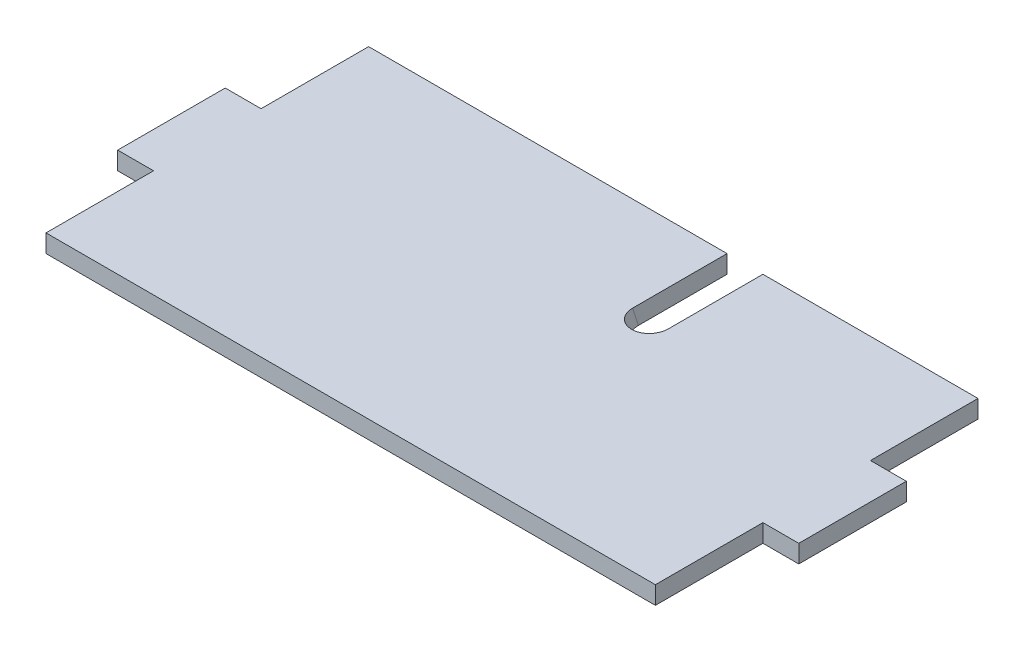
ISO-10303-21;
HEADER;
FILE_DESCRIPTION(('STEP AP214'),'2;1');
FILE_NAME('part.step','',(''),(''),'','','');
FILE_SCHEMA(('AUTOMOTIVE_DESIGN { 1 0 10303 214 1 1 1 1 }'));
ENDSEC;
DATA;
#1=APPLICATION_CONTEXT('core data for automotive mechanical design processes');
#2=APPLICATION_PROTOCOL_DEFINITION('international standard','automotive_design',2000,#1);
#3=PRODUCT_CONTEXT('',#1,'mechanical');
#4=PRODUCT('Part','Part','',(#3));
#5=PRODUCT_RELATED_PRODUCT_CATEGORY('part','',(#4));
#6=PRODUCT_DEFINITION_FORMATION('','',#4);
#7=PRODUCT_DEFINITION_CONTEXT('part definition',#1,'design');
#8=PRODUCT_DEFINITION('design','',#6,#7);
#9=PRODUCT_DEFINITION_SHAPE('','',#8);
#10=(LENGTH_UNIT() NAMED_UNIT(*) SI_UNIT(.MILLI.,.METRE.));
#11=(NAMED_UNIT(*) PLANE_ANGLE_UNIT() SI_UNIT($,.RADIAN.));
#12=(NAMED_UNIT(*) SI_UNIT($,.STERADIAN.) SOLID_ANGLE_UNIT());
#13=UNCERTAINTY_MEASURE_WITH_UNIT(LENGTH_MEASURE(1.E-05),#10,'distance_accuracy_value','');
#14=(GEOMETRIC_REPRESENTATION_CONTEXT(3) GLOBAL_UNCERTAINTY_ASSIGNED_CONTEXT((#13)) GLOBAL_UNIT_ASSIGNED_CONTEXT((#10,
#11,#12)) REPRESENTATION_CONTEXT('',''));
#15=CARTESIAN_POINT('',(0.,0.,0.));
#16=DIRECTION('',(0.,0.,1.));
#17=DIRECTION('',(1.,0.,0.));
#18=AXIS2_PLACEMENT_3D('',#15,#16,#17);
#19=CARTESIAN_POINT('',(-215.9,6.35,-88.9));
#20=DIRECTION('',(0.,0.,1.));
#21=DIRECTION('',(1.,0.,0.));
#22=AXIS2_PLACEMENT_3D('',#19,#20,#21);
#23=PLANE('',#22);
#24=DIRECTION('',(-1.,0.,0.));
#25=VECTOR('',#24,1.);
#26=CARTESIAN_POINT('',(-215.9,6.35,-88.9));
#27=LINE('',#26,#25);
#28=CARTESIAN_POINT('',(38.0999999999983,6.35,-88.9));
#29=VERTEX_POINT('',#28);
#30=CARTESIAN_POINT('',(-215.9,6.35,-88.9));
#31=VERTEX_POINT('',#30);
#32=EDGE_CURVE('E243',#29,#31,#27,.T.);
#33=ORIENTED_EDGE('',*,*,#32,.F.);
#34=DIRECTION('',(0.,1.,0.));
#35=VECTOR('',#34,1.);
#36=CARTESIAN_POINT('',(38.0999999999983,6.35,-88.9));
#37=LINE('',#36,#35);
#38=CARTESIAN_POINT('',(38.0999999999983,-6.35,-88.9));
#39=VERTEX_POINT('',#38);
#40=EDGE_CURVE('E345',#39,#29,#37,.T.);
#41=ORIENTED_EDGE('',*,*,#40,.F.);
#42=DIRECTION('',(-1.,0.,0.));
#43=VECTOR('',#42,1.);
#44=CARTESIAN_POINT('',(-215.9,-6.35,-88.9));
#45=LINE('',#44,#43);
#46=CARTESIAN_POINT('',(-215.9,-6.35,-88.9));
#47=VERTEX_POINT('',#46);
#48=EDGE_CURVE('E189',#39,#47,#45,.T.);
#49=ORIENTED_EDGE('',*,*,#48,.T.);
#50=DIRECTION('',(0.,-1.,0.));
#51=VECTOR('',#50,1.);
#52=CARTESIAN_POINT('',(-215.9,6.35,-88.9));
#53=LINE('',#52,#51);
#54=EDGE_CURVE('E195',#31,#47,#53,.T.);
#55=ORIENTED_EDGE('',*,*,#54,.F.);
#56=EDGE_LOOP('',(#33,#41,#49,#55));
#57=FACE_BOUND('',#56,.T.);
#58=ADVANCED_FACE('F42',(#57),#23,.F.);
#59=CARTESIAN_POINT('',(-215.9,6.35,-88.9));
#60=DIRECTION('',(1.,0.,0.));
#61=DIRECTION('',(0.,0.,-1.));
#62=AXIS2_PLACEMENT_3D('',#59,#60,#61);
#63=PLANE('',#62);
#64=DIRECTION('',(0.,0.,1.));
#65=VECTOR('',#64,1.);
#66=CARTESIAN_POINT('',(-215.9,-6.35,-88.9));
#67=LINE('',#66,#65);
#68=CARTESIAN_POINT('',(-215.9,-6.35,-12.7));
#69=VERTEX_POINT('',#68);
#70=EDGE_CURVE('E164',#47,#69,#67,.T.);
#71=ORIENTED_EDGE('',*,*,#70,.T.);
#72=DIRECTION('',(0.,-1.,0.));
#73=VECTOR('',#72,1.);
#74=CARTESIAN_POINT('',(-215.9,6.35,-12.7));
#75=LINE('',#74,#73);
#76=CARTESIAN_POINT('',(-215.9,6.35,-12.7));
#77=VERTEX_POINT('',#76);
#78=EDGE_CURVE('E235',#77,#69,#75,.T.);
#79=ORIENTED_EDGE('',*,*,#78,.F.);
#80=DIRECTION('',(0.,0.,1.));
#81=VECTOR('',#80,1.);
#82=CARTESIAN_POINT('',(-215.9,6.35,-88.9));
#83=LINE('',#82,#81);
#84=EDGE_CURVE('E175',#31,#77,#83,.T.);
#85=ORIENTED_EDGE('',*,*,#84,.F.);
#86=ORIENTED_EDGE('',*,*,#54,.T.);
#87=EDGE_LOOP('',(#71,#79,#85,#86));
#88=FACE_BOUND('',#87,.T.);
#89=ADVANCED_FACE('F375',(#88),#63,.F.);
#90=CARTESIAN_POINT('',(-241.3,6.35,-12.7));
#91=DIRECTION('',(0.,0.,1.));
#92=DIRECTION('',(1.,0.,0.));
#93=AXIS2_PLACEMENT_3D('',#90,#91,#92);
#94=PLANE('',#93);
#95=DIRECTION('',(-1.,0.,0.));
#96=VECTOR('',#95,1.);
#97=CARTESIAN_POINT('',(-241.3,-6.35,-12.7));
#98=LINE('',#97,#96);
#99=CARTESIAN_POINT('',(-241.3,-6.35,-12.7));
#100=VERTEX_POINT('',#99);
#101=EDGE_CURVE('E198',#69,#100,#98,.T.);
#102=ORIENTED_EDGE('',*,*,#101,.T.);
#103=DIRECTION('',(0.,-1.,0.));
#104=VECTOR('',#103,1.);
#105=CARTESIAN_POINT('',(-241.3,6.35,-12.7));
#106=LINE('',#105,#104);
#107=CARTESIAN_POINT('',(-241.3,6.35,-12.7));
#108=VERTEX_POINT('',#107);
#109=EDGE_CURVE('E231',#108,#100,#106,.T.);
#110=ORIENTED_EDGE('',*,*,#109,.F.);
#111=DIRECTION('',(-1.,0.,0.));
#112=VECTOR('',#111,1.);
#113=CARTESIAN_POINT('',(-241.3,6.35,-12.7));
#114=LINE('',#113,#112);
#115=EDGE_CURVE('E180',#77,#108,#114,.T.);
#116=ORIENTED_EDGE('',*,*,#115,.F.);
#117=ORIENTED_EDGE('',*,*,#78,.T.);
#118=EDGE_LOOP('',(#102,#110,#116,#117));
#119=FACE_BOUND('',#118,.T.);
#120=ADVANCED_FACE('F280',(#119),#94,.F.);
#121=CARTESIAN_POINT('',(-241.3,6.35,-12.7));
#122=DIRECTION('',(1.,0.,0.));
#123=DIRECTION('',(0.,0.,-1.));
#124=AXIS2_PLACEMENT_3D('',#121,#122,#123);
#125=PLANE('',#124);
#126=DIRECTION('',(0.,0.,1.));
#127=VECTOR('',#126,1.);
#128=CARTESIAN_POINT('',(-241.3,-6.35,-12.7));
#129=LINE('',#128,#127);
#130=CARTESIAN_POINT('',(-241.3,-6.35,63.5));
#131=VERTEX_POINT('',#130);
#132=EDGE_CURVE('E232',#100,#131,#129,.T.);
#133=ORIENTED_EDGE('',*,*,#132,.T.);
#134=DIRECTION('',(0.,-1.,0.));
#135=VECTOR('',#134,1.);
#136=CARTESIAN_POINT('',(-241.3,6.35,63.5));
#137=LINE('',#136,#135);
#138=CARTESIAN_POINT('',(-241.3,6.35,63.5));
#139=VERTEX_POINT('',#138);
#140=EDGE_CURVE('E227',#139,#131,#137,.T.);
#141=ORIENTED_EDGE('',*,*,#140,.F.);
#142=DIRECTION('',(0.,0.,1.));
#143=VECTOR('',#142,1.);
#144=CARTESIAN_POINT('',(-241.3,6.35,-12.7));
#145=LINE('',#144,#143);
#146=EDGE_CURVE('E268',#108,#139,#145,.T.);
#147=ORIENTED_EDGE('',*,*,#146,.F.);
#148=ORIENTED_EDGE('',*,*,#109,.T.);
#149=EDGE_LOOP('',(#133,#141,#147,#148));
#150=FACE_BOUND('',#149,.T.);
#151=ADVANCED_FACE('F285',(#150),#125,.F.);
#152=CARTESIAN_POINT('',(-215.9,6.35,63.5));
#153=DIRECTION('',(0.,0.,-1.));
#154=DIRECTION('',(-1.,0.,0.));
#155=AXIS2_PLACEMENT_3D('',#152,#153,#154);
#156=PLANE('',#155);
#157=DIRECTION('',(1.,0.,0.));
#158=VECTOR('',#157,1.);
#159=CARTESIAN_POINT('',(-215.9,-6.35,63.5));
#160=LINE('',#159,#158);
#161=CARTESIAN_POINT('',(-215.9,-6.35,63.5));
#162=VERTEX_POINT('',#161);
#163=EDGE_CURVE('E228',#131,#162,#160,.T.);
#164=ORIENTED_EDGE('',*,*,#163,.T.);
#165=DIRECTION('',(0.,-1.,0.));
#166=VECTOR('',#165,1.);
#167=CARTESIAN_POINT('',(-215.9,6.35,63.5));
#168=LINE('',#167,#166);
#169=CARTESIAN_POINT('',(-215.9,6.35,63.5));
#170=VERTEX_POINT('',#169);
#171=EDGE_CURVE('E223',#170,#162,#168,.T.);
#172=ORIENTED_EDGE('',*,*,#171,.F.);
#173=DIRECTION('',(1.,0.,0.));
#174=VECTOR('',#173,1.);
#175=CARTESIAN_POINT('',(-215.9,6.35,63.5));
#176=LINE('',#175,#174);
#177=EDGE_CURVE('E265',#139,#170,#176,.T.);
#178=ORIENTED_EDGE('',*,*,#177,.F.);
#179=ORIENTED_EDGE('',*,*,#140,.T.);
#180=EDGE_LOOP('',(#164,#172,#178,#179));
#181=FACE_BOUND('',#180,.T.);
#182=ADVANCED_FACE('F293',(#181),#156,.F.);
#183=CARTESIAN_POINT('',(-215.9,6.35,63.5));
#184=DIRECTION('',(1.,0.,0.));
#185=DIRECTION('',(0.,0.,-1.));
#186=AXIS2_PLACEMENT_3D('',#183,#184,#185);
#187=PLANE('',#186);
#188=DIRECTION('',(0.,0.,1.));
#189=VECTOR('',#188,1.);
#190=CARTESIAN_POINT('',(-215.9,-6.35,63.5));
#191=LINE('',#190,#189);
#192=CARTESIAN_POINT('',(-215.9,-6.35,139.7));
#193=VERTEX_POINT('',#192);
#194=EDGE_CURVE('E224',#162,#193,#191,.T.);
#195=ORIENTED_EDGE('',*,*,#194,.T.);
#196=DIRECTION('',(0.,-1.,0.));
#197=VECTOR('',#196,1.);
#198=CARTESIAN_POINT('',(-215.9,6.35,139.7));
#199=LINE('',#198,#197);
#200=CARTESIAN_POINT('',(-215.9,6.35,139.7));
#201=VERTEX_POINT('',#200);
#202=EDGE_CURVE('E219',#201,#193,#199,.T.);
#203=ORIENTED_EDGE('',*,*,#202,.F.);
#204=DIRECTION('',(0.,0.,1.));
#205=VECTOR('',#204,1.);
#206=CARTESIAN_POINT('',(-215.9,6.35,63.5));
#207=LINE('',#206,#205);
#208=EDGE_CURVE('E262',#170,#201,#207,.T.);
#209=ORIENTED_EDGE('',*,*,#208,.F.);
#210=ORIENTED_EDGE('',*,*,#171,.T.);
#211=EDGE_LOOP('',(#195,#203,#209,#210));
#212=FACE_BOUND('',#211,.T.);
#213=ADVANCED_FACE('F301',(#212),#187,.F.);
#214=CARTESIAN_POINT('',(-215.9,6.35,139.7));
#215=DIRECTION('',(0.,0.,-1.));
#216=DIRECTION('',(-1.,0.,0.));
#217=AXIS2_PLACEMENT_3D('',#214,#215,#216);
#218=PLANE('',#217);
#219=DIRECTION('',(1.,0.,0.));
#220=VECTOR('',#219,1.);
#221=CARTESIAN_POINT('',(-215.9,-6.35,139.7));
#222=LINE('',#221,#220);
#223=CARTESIAN_POINT('',(215.9,-6.35,139.7));
#224=VERTEX_POINT('',#223);
#225=EDGE_CURVE('E220',#193,#224,#222,.T.);
#226=ORIENTED_EDGE('',*,*,#225,.T.);
#227=DIRECTION('',(0.,-1.,0.));
#228=VECTOR('',#227,1.);
#229=CARTESIAN_POINT('',(215.9,6.35,139.7));
#230=LINE('',#229,#228);
#231=CARTESIAN_POINT('',(215.9,6.35,139.7));
#232=VERTEX_POINT('',#231);
#233=EDGE_CURVE('E215',#232,#224,#230,.T.);
#234=ORIENTED_EDGE('',*,*,#233,.F.);
#235=DIRECTION('',(1.,0.,0.));
#236=VECTOR('',#235,1.);
#237=CARTESIAN_POINT('',(-215.9,6.35,139.7));
#238=LINE('',#237,#236);
#239=EDGE_CURVE('E259',#201,#232,#238,.T.);
#240=ORIENTED_EDGE('',*,*,#239,.F.);
#241=ORIENTED_EDGE('',*,*,#202,.T.);
#242=EDGE_LOOP('',(#226,#234,#240,#241));
#243=FACE_BOUND('',#242,.T.);
#244=ADVANCED_FACE('F307',(#243),#218,.F.);
#245=CARTESIAN_POINT('',(215.9,6.35,63.5));
#246=DIRECTION('',(-1.,0.,0.));
#247=DIRECTION('',(0.,0.,1.));
#248=AXIS2_PLACEMENT_3D('',#245,#246,#247);
#249=PLANE('',#248);
#250=DIRECTION('',(0.,0.,-1.));
#251=VECTOR('',#250,1.);
#252=CARTESIAN_POINT('',(215.9,-6.35,63.5));
#253=LINE('',#252,#251);
#254=CARTESIAN_POINT('',(215.9,-6.35,63.5));
#255=VERTEX_POINT('',#254);
#256=EDGE_CURVE('E216',#224,#255,#253,.T.);
#257=ORIENTED_EDGE('',*,*,#256,.T.);
#258=DIRECTION('',(0.,-1.,0.));
#259=VECTOR('',#258,1.);
#260=CARTESIAN_POINT('',(215.9,6.35,63.5));
#261=LINE('',#260,#259);
#262=CARTESIAN_POINT('',(215.9,6.35,63.5));
#263=VERTEX_POINT('',#262);
#264=EDGE_CURVE('E211',#263,#255,#261,.T.);
#265=ORIENTED_EDGE('',*,*,#264,.F.);
#266=DIRECTION('',(0.,0.,-1.));
#267=VECTOR('',#266,1.);
#268=CARTESIAN_POINT('',(215.9,6.35,63.5));
#269=LINE('',#268,#267);
#270=EDGE_CURVE('E256',#232,#263,#269,.T.);
#271=ORIENTED_EDGE('',*,*,#270,.F.);
#272=ORIENTED_EDGE('',*,*,#233,.T.);
#273=EDGE_LOOP('',(#257,#265,#271,#272));
#274=FACE_BOUND('',#273,.T.);
#275=ADVANCED_FACE('F315',(#274),#249,.F.);
#276=CARTESIAN_POINT('',(215.9,6.35,63.5));
#277=DIRECTION('',(0.,0.,-1.));
#278=DIRECTION('',(-1.,0.,0.));
#279=AXIS2_PLACEMENT_3D('',#276,#277,#278);
#280=PLANE('',#279);
#281=DIRECTION('',(1.,0.,0.));
#282=VECTOR('',#281,1.);
#283=CARTESIAN_POINT('',(215.9,-6.35,63.5));
#284=LINE('',#283,#282);
#285=CARTESIAN_POINT('',(241.3,-6.35,63.5));
#286=VERTEX_POINT('',#285);
#287=EDGE_CURVE('E212',#255,#286,#284,.T.);
#288=ORIENTED_EDGE('',*,*,#287,.T.);
#289=DIRECTION('',(0.,-1.,0.));
#290=VECTOR('',#289,1.);
#291=CARTESIAN_POINT('',(241.3,6.35,63.5));
#292=LINE('',#291,#290);
#293=CARTESIAN_POINT('',(241.3,6.35,63.5));
#294=VERTEX_POINT('',#293);
#295=EDGE_CURVE('E207',#294,#286,#292,.T.);
#296=ORIENTED_EDGE('',*,*,#295,.F.);
#297=DIRECTION('',(1.,0.,0.));
#298=VECTOR('',#297,1.);
#299=CARTESIAN_POINT('',(215.9,6.35,63.5));
#300=LINE('',#299,#298);
#301=EDGE_CURVE('E253',#263,#294,#300,.T.);
#302=ORIENTED_EDGE('',*,*,#301,.F.);
#303=ORIENTED_EDGE('',*,*,#264,.T.);
#304=EDGE_LOOP('',(#288,#296,#302,#303));
#305=FACE_BOUND('',#304,.T.);
#306=ADVANCED_FACE('F323',(#305),#280,.F.);
#307=CARTESIAN_POINT('',(241.3,6.35,-12.7));
#308=DIRECTION('',(-1.,0.,0.));
#309=DIRECTION('',(0.,0.,1.));
#310=AXIS2_PLACEMENT_3D('',#307,#308,#309);
#311=PLANE('',#310);
#312=DIRECTION('',(0.,0.,-1.));
#313=VECTOR('',#312,1.);
#314=CARTESIAN_POINT('',(241.3,-6.35,-12.7));
#315=LINE('',#314,#313);
#316=CARTESIAN_POINT('',(241.3,-6.35,-12.7));
#317=VERTEX_POINT('',#316);
#318=EDGE_CURVE('E208',#286,#317,#315,.T.);
#319=ORIENTED_EDGE('',*,*,#318,.T.);
#320=DIRECTION('',(0.,-1.,0.));
#321=VECTOR('',#320,1.);
#322=CARTESIAN_POINT('',(241.3,6.35,-12.7));
#323=LINE('',#322,#321);
#324=CARTESIAN_POINT('',(241.3,6.35,-12.7));
#325=VERTEX_POINT('',#324);
#326=EDGE_CURVE('E203',#325,#317,#323,.T.);
#327=ORIENTED_EDGE('',*,*,#326,.F.);
#328=DIRECTION('',(0.,0.,-1.));
#329=VECTOR('',#328,1.);
#330=CARTESIAN_POINT('',(241.3,6.35,-12.7));
#331=LINE('',#330,#329);
#332=EDGE_CURVE('E250',#294,#325,#331,.T.);
#333=ORIENTED_EDGE('',*,*,#332,.F.);
#334=ORIENTED_EDGE('',*,*,#295,.T.);
#335=EDGE_LOOP('',(#319,#327,#333,#334));
#336=FACE_BOUND('',#335,.T.);
#337=ADVANCED_FACE('F329',(#336),#311,.F.);
#338=CARTESIAN_POINT('',(241.3,6.35,-12.7));
#339=DIRECTION('',(0.,0.,1.));
#340=DIRECTION('',(1.,0.,0.));
#341=AXIS2_PLACEMENT_3D('',#338,#339,#340);
#342=PLANE('',#341);
#343=DIRECTION('',(-1.,0.,0.));
#344=VECTOR('',#343,1.);
#345=CARTESIAN_POINT('',(241.3,-6.35,-12.7));
#346=LINE('',#345,#344);
#347=CARTESIAN_POINT('',(215.9,-6.35,-12.7));
#348=VERTEX_POINT('',#347);
#349=EDGE_CURVE('E204',#317,#348,#346,.T.);
#350=ORIENTED_EDGE('',*,*,#349,.T.);
#351=DIRECTION('',(0.,-1.,0.));
#352=VECTOR('',#351,1.);
#353=CARTESIAN_POINT('',(215.9,6.35,-12.7));
#354=LINE('',#353,#352);
#355=CARTESIAN_POINT('',(215.9,6.35,-12.7));
#356=VERTEX_POINT('',#355);
#357=EDGE_CURVE('E193',#356,#348,#354,.T.);
#358=ORIENTED_EDGE('',*,*,#357,.F.);
#359=DIRECTION('',(-1.,0.,0.));
#360=VECTOR('',#359,1.);
#361=CARTESIAN_POINT('',(241.3,6.35,-12.7));
#362=LINE('',#361,#360);
#363=EDGE_CURVE('E247',#325,#356,#362,.T.);
#364=ORIENTED_EDGE('',*,*,#363,.F.);
#365=ORIENTED_EDGE('',*,*,#326,.T.);
#366=EDGE_LOOP('',(#350,#358,#364,#365));
#367=FACE_BOUND('',#366,.T.);
#368=ADVANCED_FACE('F336',(#367),#342,.F.);
#369=CARTESIAN_POINT('',(215.9,6.35,-88.9));
#370=DIRECTION('',(-1.,0.,0.));
#371=DIRECTION('',(0.,0.,1.));
#372=AXIS2_PLACEMENT_3D('',#369,#370,#371);
#373=PLANE('',#372);
#374=DIRECTION('',(0.,0.,-1.));
#375=VECTOR('',#374,1.);
#376=CARTESIAN_POINT('',(215.9,-6.35,-88.9));
#377=LINE('',#376,#375);
#378=CARTESIAN_POINT('',(215.9,-6.35,-88.9));
#379=VERTEX_POINT('',#378);
#380=EDGE_CURVE('E200',#348,#379,#377,.T.);
#381=ORIENTED_EDGE('',*,*,#380,.T.);
#382=DIRECTION('',(0.,-1.,0.));
#383=VECTOR('',#382,1.);
#384=CARTESIAN_POINT('',(215.9,6.35,-88.9));
#385=LINE('',#384,#383);
#386=CARTESIAN_POINT('',(215.9,6.35,-88.9));
#387=VERTEX_POINT('',#386);
#388=EDGE_CURVE('E176',#387,#379,#385,.T.);
#389=ORIENTED_EDGE('',*,*,#388,.F.);
#390=DIRECTION('',(0.,0.,-1.));
#391=VECTOR('',#390,1.);
#392=CARTESIAN_POINT('',(215.9,6.35,-88.9));
#393=LINE('',#392,#391);
#394=EDGE_CURVE('E244',#356,#387,#393,.T.);
#395=ORIENTED_EDGE('',*,*,#394,.F.);
#396=ORIENTED_EDGE('',*,*,#357,.T.);
#397=EDGE_LOOP('',(#381,#389,#395,#396));
#398=FACE_BOUND('',#397,.T.);
#399=ADVANCED_FACE('F340',(#398),#373,.F.);
#400=CARTESIAN_POINT('',(63.4999999999985,-6.35,-88.9));
#401=VERTEX_POINT('',#400);
#402=EDGE_CURVE('E182',#379,#401,#45,.T.);
#403=ORIENTED_EDGE('',*,*,#402,.T.);
#404=DIRECTION('',(0.,-1.,0.));
#405=VECTOR('',#404,1.);
#406=CARTESIAN_POINT('',(63.4999999999985,6.34999999999997,-88.9));
#407=LINE('',#406,#405);
#408=CARTESIAN_POINT('',(63.4999999999985,6.34999999999997,-88.9));
#409=VERTEX_POINT('',#408);
#410=EDGE_CURVE('E343',#409,#401,#407,.T.);
#411=ORIENTED_EDGE('',*,*,#410,.F.);
#412=EDGE_CURVE('E52',#387,#409,#27,.T.);
#413=ORIENTED_EDGE('',*,*,#412,.F.);
#414=ORIENTED_EDGE('',*,*,#388,.T.);
#415=EDGE_LOOP('',(#403,#411,#413,#414));
#416=FACE_BOUND('',#415,.T.);
#417=ADVANCED_FACE('F342',(#416),#23,.F.);
#418=CARTESIAN_POINT('',(0.,6.35,0.));
#419=DIRECTION('',(0.,1.,0.));
#420=DIRECTION('',(0.,0.,1.));
#421=AXIS2_PLACEMENT_3D('',#418,#419,#420);
#422=PLANE('',#421);
#423=DIRECTION('',(0.,0.,-1.));
#424=VECTOR('',#423,1.);
#425=CARTESIAN_POINT('',(38.0999999999983,6.35,139.701));
#426=LINE('',#425,#424);
#427=CARTESIAN_POINT('',(38.0999999999983,6.34999999999997,-21.9362936905283));
#428=VERTEX_POINT('',#427);
#429=EDGE_CURVE('E68',#428,#29,#426,.T.);
#430=ORIENTED_EDGE('',*,*,#429,.T.);
#431=ORIENTED_EDGE('',*,*,#32,.T.);
#432=ORIENTED_EDGE('',*,*,#84,.T.);
#433=ORIENTED_EDGE('',*,*,#115,.T.);
#434=ORIENTED_EDGE('',*,*,#146,.T.);
#435=ORIENTED_EDGE('',*,*,#177,.T.);
#436=ORIENTED_EDGE('',*,*,#208,.T.);
#437=ORIENTED_EDGE('',*,*,#239,.T.);
#438=ORIENTED_EDGE('',*,*,#270,.T.);
#439=ORIENTED_EDGE('',*,*,#301,.T.);
#440=ORIENTED_EDGE('',*,*,#332,.T.);
#441=ORIENTED_EDGE('',*,*,#363,.T.);
#442=ORIENTED_EDGE('',*,*,#394,.T.);
#443=ORIENTED_EDGE('',*,*,#412,.T.);
#444=DIRECTION('',(0.,0.,-1.));
#445=VECTOR('',#444,1.);
#446=CARTESIAN_POINT('',(63.4999999999985,6.34999999999997,139.701));
#447=LINE('',#446,#445);
#448=CARTESIAN_POINT('',(63.4999999999985,6.34999999999997,-21.9362936905283));
#449=VERTEX_POINT('',#448);
#450=EDGE_CURVE('E158',#449,#409,#447,.T.);
#451=ORIENTED_EDGE('',*,*,#450,.F.);
#452=CARTESIAN_POINT('',(50.7999999999984,6.34999999999997,-21.9362936905283));
#453=DIRECTION('',(0.,1.,0.));
#454=DIRECTION('',(0.,0.,-1.));
#455=AXIS2_PLACEMENT_3D('',#452,#453,#454);
#456=ELLIPSE('',#455,13.3666923712586,12.7000000000001);
#457=EDGE_CURVE('E46',#449,#428,#456,.F.);
#458=ORIENTED_EDGE('',*,*,#457,.T.);
#459=EDGE_LOOP('',(#430,#431,#432,#433,#434,#435,#436,#437,#438,#439,#440,#441,#442,#443,#451,#458));
#460=FACE_BOUND('',#459,.T.);
#461=ADVANCED_FACE('F44',(#460),#422,.T.);
#462=CARTESIAN_POINT('',(0.,-6.35,0.));
#463=DIRECTION('',(0.,1.,0.));
#464=DIRECTION('',(0.,0.,1.));
#465=AXIS2_PLACEMENT_3D('',#462,#463,#464);
#466=PLANE('',#465);
#467=ORIENTED_EDGE('',*,*,#48,.F.);
#468=DIRECTION('',(0.,0.,-1.));
#469=VECTOR('',#468,1.);
#470=CARTESIAN_POINT('',(38.0999999999983,-6.35,139.701));
#471=LINE('',#470,#469);
#472=CARTESIAN_POINT('',(38.0999999999983,-6.34999999999997,-26.1050422974676));
#473=VERTEX_POINT('',#472);
#474=EDGE_CURVE('E353',#473,#39,#471,.T.);
#475=ORIENTED_EDGE('',*,*,#474,.F.);
#476=CARTESIAN_POINT('',(50.7999999999984,-6.34999999999997,-26.1050422974676));
#477=DIRECTION('',(0.,1.,0.));
#478=DIRECTION('',(0.,0.,-1.));
#479=AXIS2_PLACEMENT_3D('',#476,#477,#478);
#480=ELLIPSE('',#479,13.3666923712586,12.7000000000001);
#481=CARTESIAN_POINT('',(63.4999999999985,-6.34999999999997,-26.1050422974676));
#482=VERTEX_POINT('',#481);
#483=EDGE_CURVE('E11',#482,#473,#480,.F.);
#484=ORIENTED_EDGE('',*,*,#483,.F.);
#485=DIRECTION('',(0.,0.,-1.));
#486=VECTOR('',#485,1.);
#487=CARTESIAN_POINT('',(63.4999999999985,-6.35,139.701));
#488=LINE('',#487,#486);
#489=EDGE_CURVE('E60',#482,#401,#488,.T.);
#490=ORIENTED_EDGE('',*,*,#489,.T.);
#491=ORIENTED_EDGE('',*,*,#402,.F.);
#492=ORIENTED_EDGE('',*,*,#380,.F.);
#493=ORIENTED_EDGE('',*,*,#349,.F.);
#494=ORIENTED_EDGE('',*,*,#318,.F.);
#495=ORIENTED_EDGE('',*,*,#287,.F.);
#496=ORIENTED_EDGE('',*,*,#256,.F.);
#497=ORIENTED_EDGE('',*,*,#225,.F.);
#498=ORIENTED_EDGE('',*,*,#194,.F.);
#499=ORIENTED_EDGE('',*,*,#163,.F.);
#500=ORIENTED_EDGE('',*,*,#132,.F.);
#501=ORIENTED_EDGE('',*,*,#101,.F.);
#502=ORIENTED_EDGE('',*,*,#70,.F.);
#503=EDGE_LOOP('',(#467,#475,#484,#490,#491,#492,#493,#494,#495,#496,#497,#498,#499,#500,#501,#502));
#504=FACE_BOUND('',#503,.T.);
#505=ADVANCED_FACE('F365',(#504),#466,.F.);
#506=CARTESIAN_POINT('',(50.7999999999984,588.695351800179,169.21735781141));
#507=DIRECTION('',(0.,-0.950122861158083,-0.311875854635749));
#508=DIRECTION('',(0.,0.311875854635749,-0.950122861158082));
#509=AXIS2_PLACEMENT_3D('',#506,#507,#508);
#510=CYLINDRICAL_SURFACE('',#509,12.7000000000001);
#511=DIRECTION('',(0.,-0.950122861158083,-0.311875854635749));
#512=VECTOR('',#511,1.);
#513=CARTESIAN_POINT('',(38.0999999999983,588.695351800179,169.21735781141));
#514=LINE('',#513,#512);
#515=EDGE_CURVE('E165',#473,#428,#514,.F.);
#516=ORIENTED_EDGE('',*,*,#515,.T.);
#517=ORIENTED_EDGE('',*,*,#457,.F.);
#518=DIRECTION('',(0.,-0.950122861158083,-0.311875854635749));
#519=VECTOR('',#518,1.);
#520=CARTESIAN_POINT('',(63.4999999999985,588.695351800179,169.21735781141));
#521=LINE('',#520,#519);
#522=EDGE_CURVE('E155',#482,#449,#521,.F.);
#523=ORIENTED_EDGE('',*,*,#522,.F.);
#524=ORIENTED_EDGE('',*,*,#483,.T.);
#525=EDGE_LOOP('',(#516,#517,#523,#524));
#526=FACE_BOUND('',#525,.T.);
#527=ADVANCED_FACE('F173',(#526),#510,.F.);
#528=CARTESIAN_POINT('',(63.4999999999985,6.34999999999997,139.701));
#529=DIRECTION('',(1.,0.,0.));
#530=DIRECTION('',(0.,0.,-1.));
#531=AXIS2_PLACEMENT_3D('',#528,#529,#530);
#532=PLANE('',#531);
#533=ORIENTED_EDGE('',*,*,#522,.T.);
#534=ORIENTED_EDGE('',*,*,#450,.T.);
#535=ORIENTED_EDGE('',*,*,#410,.T.);
#536=ORIENTED_EDGE('',*,*,#489,.F.);
#537=EDGE_LOOP('',(#533,#534,#535,#536));
#538=FACE_BOUND('',#537,.T.);
#539=ADVANCED_FACE('F157',(#538),#532,.F.);
#540=CARTESIAN_POINT('',(38.0999999999983,6.35,139.701));
#541=DIRECTION('',(-1.,0.,0.));
#542=DIRECTION('',(0.,0.,1.));
#543=AXIS2_PLACEMENT_3D('',#540,#541,#542);
#544=PLANE('',#543);
#545=ORIENTED_EDGE('',*,*,#474,.T.);
#546=ORIENTED_EDGE('',*,*,#40,.T.);
#547=ORIENTED_EDGE('',*,*,#429,.F.);
#548=ORIENTED_EDGE('',*,*,#515,.F.);
#549=EDGE_LOOP('',(#545,#546,#547,#548));
#550=FACE_BOUND('',#549,.T.);
#551=ADVANCED_FACE('F536',(#550),#544,.F.);
#552=CLOSED_SHELL('',(#58,#89,#120,#151,#182,#213,#244,#275,#306,#337,#368,#399,#417,#461,#505,
#527,#539,#551));
#553=MANIFOLD_SOLID_BREP('B2',#552);
#554=ADVANCED_BREP_SHAPE_REPRESENTATION('',(#18,#553),#14);
#555=SHAPE_DEFINITION_REPRESENTATION(#9,#554);
ENDSEC;
END-ISO-10303-21;
